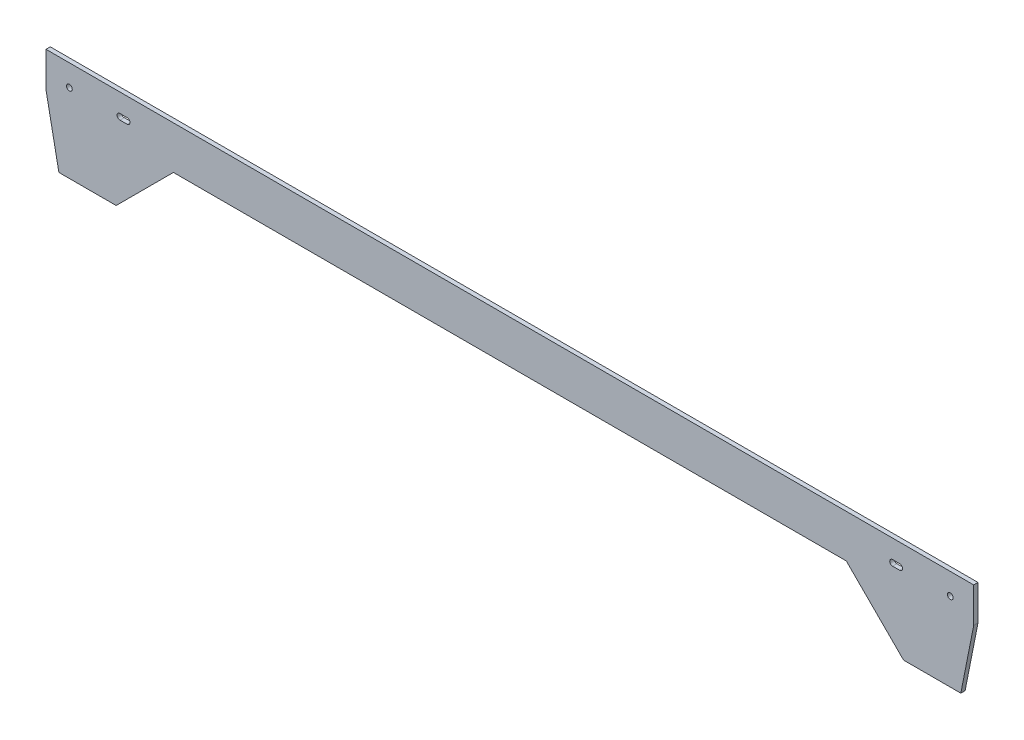
ISO-10303-21;
HEADER;
FILE_DESCRIPTION(('STEP AP214'),'2;1');
FILE_NAME('part.step','',(''),(''),'','','');
FILE_SCHEMA(('AUTOMOTIVE_DESIGN { 1 0 10303 214 1 1 1 1 }'));
ENDSEC;
DATA;
#1=APPLICATION_CONTEXT('core data for automotive mechanical design processes');
#2=APPLICATION_PROTOCOL_DEFINITION('international standard','automotive_design',2000,#1);
#3=PRODUCT_CONTEXT('',#1,'mechanical');
#4=PRODUCT('Part','Part','',(#3));
#5=PRODUCT_RELATED_PRODUCT_CATEGORY('part','',(#4));
#6=PRODUCT_DEFINITION_FORMATION('','',#4);
#7=PRODUCT_DEFINITION_CONTEXT('part definition',#1,'design');
#8=PRODUCT_DEFINITION('design','',#6,#7);
#9=PRODUCT_DEFINITION_SHAPE('','',#8);
#10=(LENGTH_UNIT() NAMED_UNIT(*) SI_UNIT(.MILLI.,.METRE.));
#11=(NAMED_UNIT(*) PLANE_ANGLE_UNIT() SI_UNIT($,.RADIAN.));
#12=(NAMED_UNIT(*) SI_UNIT($,.STERADIAN.) SOLID_ANGLE_UNIT());
#13=UNCERTAINTY_MEASURE_WITH_UNIT(LENGTH_MEASURE(1.E-05),#10,'distance_accuracy_value','');
#14=(GEOMETRIC_REPRESENTATION_CONTEXT(3) GLOBAL_UNCERTAINTY_ASSIGNED_CONTEXT((#13)) GLOBAL_UNIT_ASSIGNED_CONTEXT((#10,
#11,#12)) REPRESENTATION_CONTEXT('',''));
#15=CARTESIAN_POINT('',(0.,0.,0.));
#16=DIRECTION('',(0.,0.,1.));
#17=DIRECTION('',(1.,0.,0.));
#18=AXIS2_PLACEMENT_3D('',#15,#16,#17);
#19=CARTESIAN_POINT('',(0.,-4.00000000000001,6.));
#20=DIRECTION('',(0.,-1.,0.));
#21=DIRECTION('',(0.,0.,-1.));
#22=AXIS2_PLACEMENT_3D('',#19,#20,#21);
#23=PLANE('',#22);
#24=DIRECTION('',(-1.,0.,0.));
#25=VECTOR('',#24,1.);
#26=CARTESIAN_POINT('',(0.,-4.00000000000001,0.));
#27=LINE('',#26,#25);
#28=CARTESIAN_POINT('',(544.7,-4.00000000000001,0.));
#29=VERTEX_POINT('',#28);
#30=CARTESIAN_POINT('',(534.7,-4.00000000000001,0.));
#31=VERTEX_POINT('',#30);
#32=EDGE_CURVE('E242',#29,#31,#27,.T.);
#33=ORIENTED_EDGE('',*,*,#32,.T.);
#34=DIRECTION('',(0.,0.,-1.));
#35=VECTOR('',#34,1.);
#36=CARTESIAN_POINT('',(534.7,-4.00000000000001,6.));
#37=LINE('',#36,#35);
#38=CARTESIAN_POINT('',(534.7,-4.00000000000001,6.));
#39=VERTEX_POINT('',#38);
#40=EDGE_CURVE('E11',#39,#31,#37,.T.);
#41=ORIENTED_EDGE('',*,*,#40,.F.);
#42=DIRECTION('',(-1.,0.,0.));
#43=VECTOR('',#42,1.);
#44=CARTESIAN_POINT('',(0.,-4.00000000000001,6.));
#45=LINE('',#44,#43);
#46=CARTESIAN_POINT('',(544.7,-4.00000000000001,6.));
#47=VERTEX_POINT('',#46);
#48=EDGE_CURVE('E178',#47,#39,#45,.T.);
#49=ORIENTED_EDGE('',*,*,#48,.F.);
#50=DIRECTION('',(0.,0.,-1.));
#51=VECTOR('',#50,1.);
#52=CARTESIAN_POINT('',(544.7,-4.00000000000001,6.));
#53=LINE('',#52,#51);
#54=EDGE_CURVE('E58',#47,#29,#53,.T.);
#55=ORIENTED_EDGE('',*,*,#54,.T.);
#56=EDGE_LOOP('',(#33,#41,#49,#55));
#57=FACE_BOUND('',#56,.T.);
#58=ADVANCED_FACE('F39',(#57),#23,.F.);
#59=CARTESIAN_POINT('',(534.7,0.,6.));
#60=DIRECTION('',(0.,0.,-1.));
#61=DIRECTION('',(-1.,0.,0.));
#62=AXIS2_PLACEMENT_3D('',#59,#60,#61);
#63=CYLINDRICAL_SURFACE('',#62,4.);
#64=CARTESIAN_POINT('',(534.7,0.,0.));
#65=DIRECTION('',(0.,0.,1.));
#66=DIRECTION('',(1.,0.,0.));
#67=AXIS2_PLACEMENT_3D('',#64,#65,#66);
#68=CIRCLE('',#67,4.);
#69=CARTESIAN_POINT('',(534.7,4.,0.));
#70=VERTEX_POINT('',#69);
#71=EDGE_CURVE('E184',#31,#70,#68,.F.);
#72=ORIENTED_EDGE('',*,*,#71,.T.);
#73=DIRECTION('',(0.,0.,-1.));
#74=VECTOR('',#73,1.);
#75=CARTESIAN_POINT('',(534.7,4.,6.));
#76=LINE('',#75,#74);
#77=CARTESIAN_POINT('',(534.7,4.,6.));
#78=VERTEX_POINT('',#77);
#79=EDGE_CURVE('E49',#78,#70,#76,.T.);
#80=ORIENTED_EDGE('',*,*,#79,.F.);
#81=CARTESIAN_POINT('',(534.7,0.,6.));
#82=DIRECTION('',(0.,0.,1.));
#83=DIRECTION('',(1.,0.,0.));
#84=AXIS2_PLACEMENT_3D('',#81,#82,#83);
#85=CIRCLE('',#84,4.);
#86=EDGE_CURVE('E172',#39,#78,#85,.F.);
#87=ORIENTED_EDGE('',*,*,#86,.F.);
#88=ORIENTED_EDGE('',*,*,#40,.T.);
#89=EDGE_LOOP('',(#72,#80,#87,#88));
#90=FACE_BOUND('',#89,.T.);
#91=ADVANCED_FACE('F183',(#90),#63,.F.);
#92=CARTESIAN_POINT('',(0.,4.00000000000111,6.));
#93=DIRECTION('',(0.,-1.,0.));
#94=DIRECTION('',(1.,0.,0.));
#95=AXIS2_PLACEMENT_3D('',#92,#93,#94);
#96=PLANE('',#95);
#97=DIRECTION('',(-1.,0.,0.));
#98=VECTOR('',#97,1.);
#99=CARTESIAN_POINT('',(0.,4.00000000000111,0.));
#100=LINE('',#99,#98);
#101=CARTESIAN_POINT('',(544.7,3.99999999999998,0.));
#102=VERTEX_POINT('',#101);
#103=EDGE_CURVE('E245',#102,#70,#100,.T.);
#104=ORIENTED_EDGE('',*,*,#103,.F.);
#105=DIRECTION('',(0.,0.,-1.));
#106=VECTOR('',#105,1.);
#107=CARTESIAN_POINT('',(544.7,3.99999999999998,6.));
#108=LINE('',#107,#106);
#109=CARTESIAN_POINT('',(544.7,3.99999999999998,6.));
#110=VERTEX_POINT('',#109);
#111=EDGE_CURVE('E114',#110,#102,#108,.T.);
#112=ORIENTED_EDGE('',*,*,#111,.F.);
#113=DIRECTION('',(-1.,0.,0.));
#114=VECTOR('',#113,1.);
#115=CARTESIAN_POINT('',(0.,4.00000000000111,6.));
#116=LINE('',#115,#114);
#117=EDGE_CURVE('E177',#110,#78,#116,.T.);
#118=ORIENTED_EDGE('',*,*,#117,.T.);
#119=ORIENTED_EDGE('',*,*,#79,.T.);
#120=EDGE_LOOP('',(#104,#112,#118,#119));
#121=FACE_BOUND('',#120,.T.);
#122=ADVANCED_FACE('F188',(#121),#96,.T.);
#123=CARTESIAN_POINT('',(647.999999999997,-5.57921056292962E-11,6.));
#124=DIRECTION('',(1.,0.,0.));
#125=DIRECTION('',(0.,1.,0.));
#126=AXIS2_PLACEMENT_3D('',#123,#124,#125);
#127=PLANE('',#126);
#128=DIRECTION('',(0.,-1.,0.));
#129=VECTOR('',#128,1.);
#130=CARTESIAN_POINT('',(647.999999999997,-5.57921056292962E-11,0.));
#131=LINE('',#130,#129);
#132=CARTESIAN_POINT('',(648.,30.0000000000096,0.));
#133=VERTEX_POINT('',#132);
#134=CARTESIAN_POINT('',(647.999999999995,-19.0000000000165,0.));
#135=VERTEX_POINT('',#134);
#136=EDGE_CURVE('E206',#133,#135,#131,.T.);
#137=ORIENTED_EDGE('',*,*,#136,.F.);
#138=DIRECTION('',(0.,0.,-1.));
#139=VECTOR('',#138,1.);
#140=CARTESIAN_POINT('',(648.,30.0000000000096,6.));
#141=LINE('',#140,#139);
#142=CARTESIAN_POINT('',(648.,30.0000000000096,6.));
#143=VERTEX_POINT('',#142);
#144=EDGE_CURVE('E252',#143,#133,#141,.T.);
#145=ORIENTED_EDGE('',*,*,#144,.F.);
#146=DIRECTION('',(0.,-1.,0.));
#147=VECTOR('',#146,1.);
#148=CARTESIAN_POINT('',(647.999999999997,-5.57921056292962E-11,6.));
#149=LINE('',#148,#147);
#150=CARTESIAN_POINT('',(647.999999999995,-19.0000000000165,6.));
#151=VERTEX_POINT('',#150);
#152=EDGE_CURVE('E301',#143,#151,#149,.T.);
#153=ORIENTED_EDGE('',*,*,#152,.T.);
#154=DIRECTION('',(0.,0.,-1.));
#155=VECTOR('',#154,1.);
#156=CARTESIAN_POINT('',(647.999999999995,-19.0000000000165,6.));
#157=LINE('',#156,#155);
#158=EDGE_CURVE('E254',#151,#135,#157,.T.);
#159=ORIENTED_EDGE('',*,*,#158,.T.);
#160=EDGE_LOOP('',(#137,#145,#153,#159));
#161=FACE_BOUND('',#160,.T.);
#162=ADVANCED_FACE('F407',(#161),#127,.T.);
#163=CARTESIAN_POINT('',(-6.03900610071994E-12,29.9999999998792,6.));
#164=DIRECTION('',(2.01300203358142E-13,-1.,0.));
#165=DIRECTION('',(1.,2.01300203358142E-13,0.));
#166=AXIS2_PLACEMENT_3D('',#163,#164,#165);
#167=PLANE('',#166);
#168=DIRECTION('',(-1.,-2.01300203358142E-13,0.));
#169=VECTOR('',#168,1.);
#170=CARTESIAN_POINT('',(-6.03900610071994E-12,29.9999999998792,0.));
#171=LINE('',#170,#169);
#172=CARTESIAN_POINT('',(-648.,30.,0.));
#173=VERTEX_POINT('',#172);
#174=EDGE_CURVE('E209',#133,#173,#171,.T.);
#175=ORIENTED_EDGE('',*,*,#174,.T.);
#176=DIRECTION('',(0.,0.,-1.));
#177=VECTOR('',#176,1.);
#178=CARTESIAN_POINT('',(-648.,30.,6.));
#179=LINE('',#178,#177);
#180=CARTESIAN_POINT('',(-648.,30.,6.));
#181=VERTEX_POINT('',#180);
#182=EDGE_CURVE('E272',#181,#173,#179,.T.);
#183=ORIENTED_EDGE('',*,*,#182,.F.);
#184=DIRECTION('',(-1.,-2.01300203358142E-13,0.));
#185=VECTOR('',#184,1.);
#186=CARTESIAN_POINT('',(-6.03900610071994E-12,29.9999999998792,6.));
#187=LINE('',#186,#185);
#188=EDGE_CURVE('E305',#143,#181,#187,.T.);
#189=ORIENTED_EDGE('',*,*,#188,.F.);
#190=ORIENTED_EDGE('',*,*,#144,.T.);
#191=EDGE_LOOP('',(#175,#183,#189,#190));
#192=FACE_BOUND('',#191,.T.);
#193=ADVANCED_FACE('F403',(#192),#167,.F.);
#194=CARTESIAN_POINT('',(-648.,0.,6.));
#195=DIRECTION('',(1.,0.,0.));
#196=DIRECTION('',(0.,0.,-1.));
#197=AXIS2_PLACEMENT_3D('',#194,#195,#196);
#198=PLANE('',#197);
#199=DIRECTION('',(0.,-1.,0.));
#200=VECTOR('',#199,1.);
#201=CARTESIAN_POINT('',(-648.,0.,0.));
#202=LINE('',#201,#200);
#203=CARTESIAN_POINT('',(-648.,-19.,0.));
#204=VERTEX_POINT('',#203);
#205=EDGE_CURVE('E212',#173,#204,#202,.T.);
#206=ORIENTED_EDGE('',*,*,#205,.T.);
#207=DIRECTION('',(0.,0.,-1.));
#208=VECTOR('',#207,1.);
#209=CARTESIAN_POINT('',(-648.,-19.,6.));
#210=LINE('',#209,#208);
#211=CARTESIAN_POINT('',(-648.,-19.,6.));
#212=VERTEX_POINT('',#211);
#213=EDGE_CURVE('E269',#212,#204,#210,.T.);
#214=ORIENTED_EDGE('',*,*,#213,.F.);
#215=DIRECTION('',(0.,-1.,0.));
#216=VECTOR('',#215,1.);
#217=CARTESIAN_POINT('',(-648.,0.,6.));
#218=LINE('',#217,#216);
#219=EDGE_CURVE('E312',#181,#212,#218,.T.);
#220=ORIENTED_EDGE('',*,*,#219,.F.);
#221=ORIENTED_EDGE('',*,*,#182,.T.);
#222=EDGE_LOOP('',(#206,#214,#220,#221));
#223=FACE_BOUND('',#222,.T.);
#224=ADVANCED_FACE('F399',(#223),#198,.F.);
#225=CARTESIAN_POINT('',(-627.217896571761,-124.065078442766,6.));
#226=DIRECTION('',(0.980993105174429,0.194042592232304,0.));
#227=DIRECTION('',(-0.194042592232304,0.980993105174429,0.));
#228=AXIS2_PLACEMENT_3D('',#225,#226,#227);
#229=PLANE('',#228);
#230=DIRECTION('',(0.194042592232304,-0.980993105174429,0.));
#231=VECTOR('',#230,1.);
#232=CARTESIAN_POINT('',(-627.217896571761,-124.065078442766,0.));
#233=LINE('',#232,#231);
#234=CARTESIAN_POINT('',(-630.,-110.,0.));
#235=VERTEX_POINT('',#234);
#236=EDGE_CURVE('E215',#204,#235,#233,.T.);
#237=ORIENTED_EDGE('',*,*,#236,.T.);
#238=DIRECTION('',(0.,0.,-1.));
#239=VECTOR('',#238,1.);
#240=CARTESIAN_POINT('',(-630.,-110.,6.));
#241=LINE('',#240,#239);
#242=CARTESIAN_POINT('',(-630.,-110.,6.));
#243=VERTEX_POINT('',#242);
#244=EDGE_CURVE('E267',#243,#235,#241,.T.);
#245=ORIENTED_EDGE('',*,*,#244,.F.);
#246=DIRECTION('',(0.194042592232304,-0.980993105174429,0.));
#247=VECTOR('',#246,1.);
#248=CARTESIAN_POINT('',(-627.217896571761,-124.065078442766,6.));
#249=LINE('',#248,#247);
#250=EDGE_CURVE('E315',#212,#243,#249,.T.);
#251=ORIENTED_EDGE('',*,*,#250,.F.);
#252=ORIENTED_EDGE('',*,*,#213,.T.);
#253=EDGE_LOOP('',(#237,#245,#251,#252));
#254=FACE_BOUND('',#253,.T.);
#255=ADVANCED_FACE('F395',(#254),#229,.F.);
#256=CARTESIAN_POINT('',(0.,-110.,6.));
#257=DIRECTION('',(0.,-1.,0.));
#258=DIRECTION('',(0.,0.,-1.));
#259=AXIS2_PLACEMENT_3D('',#256,#257,#258);
#260=PLANE('',#259);
#261=DIRECTION('',(-1.,0.,0.));
#262=VECTOR('',#261,1.);
#263=CARTESIAN_POINT('',(0.,-110.,0.));
#264=LINE('',#263,#262);
#265=CARTESIAN_POINT('',(-550.,-110.,0.));
#266=VERTEX_POINT('',#265);
#267=EDGE_CURVE('E218',#266,#235,#264,.T.);
#268=ORIENTED_EDGE('',*,*,#267,.F.);
#269=DIRECTION('',(0.,0.,-1.));
#270=VECTOR('',#269,1.);
#271=CARTESIAN_POINT('',(-550.,-110.,6.));
#272=LINE('',#271,#270);
#273=CARTESIAN_POINT('',(-550.,-110.,6.));
#274=VERTEX_POINT('',#273);
#275=EDGE_CURVE('E265',#274,#266,#272,.T.);
#276=ORIENTED_EDGE('',*,*,#275,.F.);
#277=DIRECTION('',(-1.,0.,0.));
#278=VECTOR('',#277,1.);
#279=CARTESIAN_POINT('',(0.,-110.,6.));
#280=LINE('',#279,#278);
#281=EDGE_CURVE('E317',#274,#243,#280,.T.);
#282=ORIENTED_EDGE('',*,*,#281,.T.);
#283=ORIENTED_EDGE('',*,*,#244,.T.);
#284=EDGE_LOOP('',(#268,#276,#282,#283));
#285=FACE_BOUND('',#284,.T.);
#286=ADVANCED_FACE('F391',(#285),#260,.T.);
#287=CARTESIAN_POINT('',(-220.000000000001,220.,6.));
#288=DIRECTION('',(-0.707106781186549,0.707106781186546,0.));
#289=DIRECTION('',(-0.707106781186546,-0.707106781186549,0.));
#290=AXIS2_PLACEMENT_3D('',#287,#288,#289);
#291=PLANE('',#290);
#292=DIRECTION('',(0.707106781186546,0.707106781186549,0.));
#293=VECTOR('',#292,1.);
#294=CARTESIAN_POINT('',(-220.000000000001,220.,0.));
#295=LINE('',#294,#293);
#296=CARTESIAN_POINT('',(-470.000000000001,-30.0000000000002,0.));
#297=VERTEX_POINT('',#296);
#298=EDGE_CURVE('E221',#266,#297,#295,.T.);
#299=ORIENTED_EDGE('',*,*,#298,.T.);
#300=DIRECTION('',(0.,0.,-1.));
#301=VECTOR('',#300,1.);
#302=CARTESIAN_POINT('',(-470.000000000001,-30.0000000000002,6.));
#303=LINE('',#302,#301);
#304=CARTESIAN_POINT('',(-470.000000000001,-30.0000000000002,6.));
#305=VERTEX_POINT('',#304);
#306=EDGE_CURVE('E262',#305,#297,#303,.T.);
#307=ORIENTED_EDGE('',*,*,#306,.F.);
#308=DIRECTION('',(0.707106781186546,0.707106781186549,0.));
#309=VECTOR('',#308,1.);
#310=CARTESIAN_POINT('',(-220.000000000001,220.,6.));
#311=LINE('',#310,#309);
#312=EDGE_CURVE('E320',#274,#305,#311,.T.);
#313=ORIENTED_EDGE('',*,*,#312,.F.);
#314=ORIENTED_EDGE('',*,*,#275,.T.);
#315=EDGE_LOOP('',(#299,#307,#313,#314));
#316=FACE_BOUND('',#315,.T.);
#317=ADVANCED_FACE('F387',(#316),#291,.F.);
#318=CARTESIAN_POINT('',(2.23668601370601E-13,-29.9999999999966,6.));
#319=DIRECTION('',(0.,1.,0.));
#320=DIRECTION('',(-1.,0.,0.));
#321=AXIS2_PLACEMENT_3D('',#318,#319,#320);
#322=PLANE('',#321);
#323=DIRECTION('',(1.,0.,0.));
#324=VECTOR('',#323,1.);
#325=CARTESIAN_POINT('',(2.23668601370601E-13,-29.9999999999966,0.));
#326=LINE('',#325,#324);
#327=CARTESIAN_POINT('',(470.000000000001,-29.9999999999932,0.));
#328=VERTEX_POINT('',#327);
#329=EDGE_CURVE('E224',#297,#328,#326,.T.);
#330=ORIENTED_EDGE('',*,*,#329,.T.);
#331=DIRECTION('',(0.,0.,-1.));
#332=VECTOR('',#331,1.);
#333=CARTESIAN_POINT('',(470.000000000001,-29.9999999999932,6.));
#334=LINE('',#333,#332);
#335=CARTESIAN_POINT('',(470.000000000001,-29.9999999999932,6.));
#336=VERTEX_POINT('',#335);
#337=EDGE_CURVE('E260',#336,#328,#334,.T.);
#338=ORIENTED_EDGE('',*,*,#337,.F.);
#339=DIRECTION('',(1.,0.,0.));
#340=VECTOR('',#339,1.);
#341=CARTESIAN_POINT('',(2.23668601370601E-13,-29.9999999999966,6.));
#342=LINE('',#341,#340);
#343=EDGE_CURVE('E323',#305,#336,#342,.T.);
#344=ORIENTED_EDGE('',*,*,#343,.F.);
#345=ORIENTED_EDGE('',*,*,#306,.T.);
#346=EDGE_LOOP('',(#330,#338,#344,#345));
#347=FACE_BOUND('',#346,.T.);
#348=ADVANCED_FACE('F383',(#347),#322,.F.);
#349=CARTESIAN_POINT('',(220.000000000023,220.000000000005,6.));
#350=DIRECTION('',(-0.707106781186576,-0.707106781186518,0.));
#351=DIRECTION('',(0.707106781186518,-0.707106781186576,0.));
#352=AXIS2_PLACEMENT_3D('',#349,#350,#351);
#353=PLANE('',#352);
#354=DIRECTION('',(-0.707106781186518,0.707106781186577,0.));
#355=VECTOR('',#354,1.);
#356=CARTESIAN_POINT('',(220.000000000023,220.000000000005,0.));
#357=LINE('',#356,#355);
#358=CARTESIAN_POINT('',(550.000000000007,-110.000000000006,0.));
#359=VERTEX_POINT('',#358);
#360=EDGE_CURVE('E227',#359,#328,#357,.T.);
#361=ORIENTED_EDGE('',*,*,#360,.F.);
#362=DIRECTION('',(0.,0.,-1.));
#363=VECTOR('',#362,1.);
#364=CARTESIAN_POINT('',(550.000000000007,-110.000000000006,6.));
#365=LINE('',#364,#363);
#366=CARTESIAN_POINT('',(550.000000000007,-110.000000000006,6.));
#367=VERTEX_POINT('',#366);
#368=EDGE_CURVE('E258',#367,#359,#365,.T.);
#369=ORIENTED_EDGE('',*,*,#368,.F.);
#370=DIRECTION('',(-0.707106781186518,0.707106781186577,0.));
#371=VECTOR('',#370,1.);
#372=CARTESIAN_POINT('',(220.000000000023,220.000000000005,6.));
#373=LINE('',#372,#371);
#374=EDGE_CURVE('E325',#367,#336,#373,.T.);
#375=ORIENTED_EDGE('',*,*,#374,.T.);
#376=ORIENTED_EDGE('',*,*,#337,.T.);
#377=EDGE_LOOP('',(#361,#369,#375,#376));
#378=FACE_BOUND('',#377,.T.);
#379=ADVANCED_FACE('F379',(#378),#353,.T.);
#380=CARTESIAN_POINT('',(0.,-110.000000000006,6.));
#381=DIRECTION('',(0.,-1.,0.));
#382=DIRECTION('',(0.,0.,-1.));
#383=AXIS2_PLACEMENT_3D('',#380,#381,#382);
#384=PLANE('',#383);
#385=DIRECTION('',(-1.,0.,0.));
#386=VECTOR('',#385,1.);
#387=CARTESIAN_POINT('',(0.,-110.000000000006,0.));
#388=LINE('',#387,#386);
#389=CARTESIAN_POINT('',(629.999999999999,-110.000000000006,0.));
#390=VERTEX_POINT('',#389);
#391=EDGE_CURVE('E230',#390,#359,#388,.T.);
#392=ORIENTED_EDGE('',*,*,#391,.F.);
#393=DIRECTION('',(0.,0.,-1.));
#394=VECTOR('',#393,1.);
#395=CARTESIAN_POINT('',(629.999999999999,-110.000000000006,6.));
#396=LINE('',#395,#394);
#397=CARTESIAN_POINT('',(629.999999999999,-110.000000000006,6.));
#398=VERTEX_POINT('',#397);
#399=EDGE_CURVE('E256',#398,#390,#396,.T.);
#400=ORIENTED_EDGE('',*,*,#399,.F.);
#401=DIRECTION('',(-1.,0.,0.));
#402=VECTOR('',#401,1.);
#403=CARTESIAN_POINT('',(0.,-110.000000000006,6.));
#404=LINE('',#403,#402);
#405=EDGE_CURVE('E328',#398,#367,#404,.T.);
#406=ORIENTED_EDGE('',*,*,#405,.T.);
#407=ORIENTED_EDGE('',*,*,#368,.T.);
#408=EDGE_LOOP('',(#392,#400,#406,#407));
#409=FACE_BOUND('',#408,.T.);
#410=ADVANCED_FACE('F376',(#409),#384,.T.);
#411=CARTESIAN_POINT('',(-534.7,0.,6.));
#412=DIRECTION('',(0.,0.,-1.));
#413=DIRECTION('',(-1.,0.,0.));
#414=AXIS2_PLACEMENT_3D('',#411,#412,#413);
#415=CYLINDRICAL_SURFACE('',#414,4.);
#416=CARTESIAN_POINT('',(-534.7,0.,0.));
#417=DIRECTION('',(0.,0.,1.));
#418=DIRECTION('',(1.,0.,0.));
#419=AXIS2_PLACEMENT_3D('',#416,#417,#418);
#420=CIRCLE('',#419,4.);
#421=CARTESIAN_POINT('',(-534.7,-4.00000000000001,0.));
#422=VERTEX_POINT('',#421);
#423=CARTESIAN_POINT('',(-534.7,4.,0.));
#424=VERTEX_POINT('',#423);
#425=EDGE_CURVE('E195',#422,#424,#420,.T.);
#426=ORIENTED_EDGE('',*,*,#425,.F.);
#427=DIRECTION('',(0.,0.,-1.));
#428=VECTOR('',#427,1.);
#429=CARTESIAN_POINT('',(-534.7,-4.00000000000001,6.));
#430=LINE('',#429,#428);
#431=CARTESIAN_POINT('',(-534.7,-4.00000000000001,6.));
#432=VERTEX_POINT('',#431);
#433=EDGE_CURVE('E43',#432,#422,#430,.T.);
#434=ORIENTED_EDGE('',*,*,#433,.F.);
#435=CARTESIAN_POINT('',(-534.7,0.,6.));
#436=DIRECTION('',(0.,0.,1.));
#437=DIRECTION('',(1.,0.,0.));
#438=AXIS2_PLACEMENT_3D('',#435,#436,#437);
#439=CIRCLE('',#438,4.);
#440=CARTESIAN_POINT('',(-534.7,4.,6.));
#441=VERTEX_POINT('',#440);
#442=EDGE_CURVE('E250',#432,#441,#439,.T.);
#443=ORIENTED_EDGE('',*,*,#442,.T.);
#444=DIRECTION('',(0.,0.,-1.));
#445=VECTOR('',#444,1.);
#446=CARTESIAN_POINT('',(-534.7,4.,6.));
#447=LINE('',#446,#445);
#448=EDGE_CURVE('E191',#441,#424,#447,.T.);
#449=ORIENTED_EDGE('',*,*,#448,.T.);
#450=EDGE_LOOP('',(#426,#434,#443,#449));
#451=FACE_BOUND('',#450,.T.);
#452=ADVANCED_FACE('F41',(#451),#415,.F.);
#453=CARTESIAN_POINT('',(0.,-4.00000000000001,6.));
#454=DIRECTION('',(0.,1.,0.));
#455=DIRECTION('',(0.,0.,1.));
#456=AXIS2_PLACEMENT_3D('',#453,#454,#455);
#457=PLANE('',#456);
#458=DIRECTION('',(1.,0.,0.));
#459=VECTOR('',#458,1.);
#460=CARTESIAN_POINT('',(0.,-4.00000000000001,0.));
#461=LINE('',#460,#459);
#462=CARTESIAN_POINT('',(-544.7,-4.00000000000001,0.));
#463=VERTEX_POINT('',#462);
#464=EDGE_CURVE('E198',#463,#422,#461,.T.);
#465=ORIENTED_EDGE('',*,*,#464,.F.);
#466=DIRECTION('',(0.,0.,-1.));
#467=VECTOR('',#466,1.);
#468=CARTESIAN_POINT('',(-544.7,-4.00000000000001,6.));
#469=LINE('',#468,#467);
#470=CARTESIAN_POINT('',(-544.7,-4.00000000000001,6.));
#471=VERTEX_POINT('',#470);
#472=EDGE_CURVE('E279',#471,#463,#469,.T.);
#473=ORIENTED_EDGE('',*,*,#472,.F.);
#474=DIRECTION('',(1.,0.,0.));
#475=VECTOR('',#474,1.);
#476=CARTESIAN_POINT('',(0.,-4.00000000000001,6.));
#477=LINE('',#476,#475);
#478=EDGE_CURVE('E288',#471,#432,#477,.T.);
#479=ORIENTED_EDGE('',*,*,#478,.T.);
#480=ORIENTED_EDGE('',*,*,#433,.T.);
#481=EDGE_LOOP('',(#465,#473,#479,#480));
#482=FACE_BOUND('',#481,.T.);
#483=ADVANCED_FACE('F286',(#482),#457,.T.);
#484=CARTESIAN_POINT('',(-544.7,0.,6.));
#485=DIRECTION('',(0.,0.,-1.));
#486=DIRECTION('',(-1.,0.,0.));
#487=AXIS2_PLACEMENT_3D('',#484,#485,#486);
#488=CYLINDRICAL_SURFACE('',#487,3.99999999999999);
#489=CARTESIAN_POINT('',(-544.7,0.,0.));
#490=DIRECTION('',(0.,0.,1.));
#491=DIRECTION('',(1.,0.,0.));
#492=AXIS2_PLACEMENT_3D('',#489,#490,#491);
#493=CIRCLE('',#492,3.99999999999999);
#494=CARTESIAN_POINT('',(-544.7,3.99999999999998,0.));
#495=VERTEX_POINT('',#494);
#496=EDGE_CURVE('E201',#463,#495,#493,.F.);
#497=ORIENTED_EDGE('',*,*,#496,.T.);
#498=DIRECTION('',(0.,0.,-1.));
#499=VECTOR('',#498,1.);
#500=CARTESIAN_POINT('',(-544.7,3.99999999999998,6.));
#501=LINE('',#500,#499);
#502=CARTESIAN_POINT('',(-544.7,3.99999999999998,6.));
#503=VERTEX_POINT('',#502);
#504=EDGE_CURVE('E277',#503,#495,#501,.T.);
#505=ORIENTED_EDGE('',*,*,#504,.F.);
#506=CARTESIAN_POINT('',(-544.7,0.,6.));
#507=DIRECTION('',(0.,0.,1.));
#508=DIRECTION('',(1.,0.,0.));
#509=AXIS2_PLACEMENT_3D('',#506,#507,#508);
#510=CIRCLE('',#509,3.99999999999999);
#511=EDGE_CURVE('E302',#471,#503,#510,.F.);
#512=ORIENTED_EDGE('',*,*,#511,.F.);
#513=ORIENTED_EDGE('',*,*,#472,.T.);
#514=EDGE_LOOP('',(#497,#505,#512,#513));
#515=FACE_BOUND('',#514,.T.);
#516=ADVANCED_FACE('F295',(#515),#488,.F.);
#517=CARTESIAN_POINT('',(615.3,9.17134403136266E-12,6.));
#518=DIRECTION('',(0.,0.,-1.));
#519=DIRECTION('',(-1.,0.,0.));
#520=AXIS2_PLACEMENT_3D('',#517,#518,#519);
#521=CYLINDRICAL_SURFACE('',#520,3.99999999999999);
#522=CARTESIAN_POINT('',(615.3,9.17134403136266E-12,6.));
#523=DIRECTION('',(0.,0.,1.));
#524=DIRECTION('',(1.,0.,0.));
#525=AXIS2_PLACEMENT_3D('',#522,#523,#524);
#526=CIRCLE('',#525,3.99999999999999);
#527=CARTESIAN_POINT('',(619.3,9.17134403136266E-12,6.));
#528=VERTEX_POINT('',#527);
#529=EDGE_CURVE('E337',#528,#528,#526,.F.);
#530=ORIENTED_EDGE('',*,*,#529,.F.);
#531=EDGE_LOOP('',(#530));
#532=FACE_BOUND('',#531,.T.);
#533=CARTESIAN_POINT('',(615.3,9.17134403136266E-12,0.));
#534=DIRECTION('',(0.,0.,1.));
#535=DIRECTION('',(1.,0.,0.));
#536=AXIS2_PLACEMENT_3D('',#533,#534,#535);
#537=CIRCLE('',#536,3.99999999999999);
#538=CARTESIAN_POINT('',(619.3,9.17134403136266E-12,0.));
#539=VERTEX_POINT('',#538);
#540=EDGE_CURVE('E239',#539,#539,#537,.F.);
#541=ORIENTED_EDGE('',*,*,#540,.T.);
#542=EDGE_LOOP('',(#541));
#543=FACE_BOUND('',#542,.T.);
#544=ADVANCED_FACE('F342',(#532,#543),#521,.F.);
#545=CARTESIAN_POINT('',(-615.3,0.,6.));
#546=DIRECTION('',(0.,0.,-1.));
#547=DIRECTION('',(-1.,0.,0.));
#548=AXIS2_PLACEMENT_3D('',#545,#546,#547);
#549=CYLINDRICAL_SURFACE('',#548,3.99999999999999);
#550=CARTESIAN_POINT('',(-615.3,0.,6.));
#551=DIRECTION('',(0.,0.,1.));
#552=DIRECTION('',(1.,0.,0.));
#553=AXIS2_PLACEMENT_3D('',#550,#551,#552);
#554=CIRCLE('',#553,3.99999999999999);
#555=CARTESIAN_POINT('',(-611.3,0.,6.));
#556=VERTEX_POINT('',#555);
#557=EDGE_CURVE('E334',#556,#556,#554,.T.);
#558=ORIENTED_EDGE('',*,*,#557,.T.);
#559=EDGE_LOOP('',(#558));
#560=FACE_BOUND('',#559,.T.);
#561=CARTESIAN_POINT('',(-615.3,0.,0.));
#562=DIRECTION('',(0.,0.,1.));
#563=DIRECTION('',(1.,0.,0.));
#564=AXIS2_PLACEMENT_3D('',#561,#562,#563);
#565=CIRCLE('',#564,3.99999999999999);
#566=CARTESIAN_POINT('',(-611.3,0.,0.));
#567=VERTEX_POINT('',#566);
#568=EDGE_CURVE('E236',#567,#567,#565,.T.);
#569=ORIENTED_EDGE('',*,*,#568,.F.);
#570=EDGE_LOOP('',(#569));
#571=FACE_BOUND('',#570,.T.);
#572=ADVANCED_FACE('F345',(#560,#571),#549,.F.);
#573=CARTESIAN_POINT('',(627.217896571762,-124.065078442757,6.));
#574=DIRECTION('',(0.980993105174431,-0.194042592232291,0.));
#575=DIRECTION('',(0.194042592232291,0.980993105174431,0.));
#576=AXIS2_PLACEMENT_3D('',#573,#574,#575);
#577=PLANE('',#576);
#578=DIRECTION('',(-0.194042592232291,-0.980993105174431,0.));
#579=VECTOR('',#578,1.);
#580=CARTESIAN_POINT('',(627.217896571762,-124.065078442757,0.));
#581=LINE('',#580,#579);
#582=EDGE_CURVE('E233',#135,#390,#581,.T.);
#583=ORIENTED_EDGE('',*,*,#582,.F.);
#584=ORIENTED_EDGE('',*,*,#158,.F.);
#585=DIRECTION('',(-0.194042592232291,-0.980993105174431,0.));
#586=VECTOR('',#585,1.);
#587=CARTESIAN_POINT('',(627.217896571762,-124.065078442757,6.));
#588=LINE('',#587,#586);
#589=EDGE_CURVE('E331',#151,#398,#588,.T.);
#590=ORIENTED_EDGE('',*,*,#589,.T.);
#591=ORIENTED_EDGE('',*,*,#399,.T.);
#592=EDGE_LOOP('',(#583,#584,#590,#591));
#593=FACE_BOUND('',#592,.T.);
#594=ADVANCED_FACE('F360',(#593),#577,.T.);
#595=CARTESIAN_POINT('',(0.,4.00000000000111,6.));
#596=DIRECTION('',(0.,1.,0.));
#597=DIRECTION('',(-1.,0.,0.));
#598=AXIS2_PLACEMENT_3D('',#595,#596,#597);
#599=PLANE('',#598);
#600=DIRECTION('',(1.,0.,0.));
#601=VECTOR('',#600,1.);
#602=CARTESIAN_POINT('',(0.,4.00000000000111,0.));
#603=LINE('',#602,#601);
#604=EDGE_CURVE('E203',#495,#424,#603,.T.);
#605=ORIENTED_EDGE('',*,*,#604,.T.);
#606=ORIENTED_EDGE('',*,*,#448,.F.);
#607=DIRECTION('',(1.,0.,0.));
#608=VECTOR('',#607,1.);
#609=CARTESIAN_POINT('',(0.,4.00000000000111,6.));
#610=LINE('',#609,#608);
#611=EDGE_CURVE('E299',#503,#441,#610,.T.);
#612=ORIENTED_EDGE('',*,*,#611,.F.);
#613=ORIENTED_EDGE('',*,*,#504,.T.);
#614=EDGE_LOOP('',(#605,#606,#612,#613));
#615=FACE_BOUND('',#614,.T.);
#616=ADVANCED_FACE('F298',(#615),#599,.F.);
#617=CARTESIAN_POINT('',(544.7,8.10969326406485E-12,6.));
#618=DIRECTION('',(0.,0.,-1.));
#619=DIRECTION('',(-1.,0.,0.));
#620=AXIS2_PLACEMENT_3D('',#617,#618,#619);
#621=CYLINDRICAL_SURFACE('',#620,3.99999999999999);
#622=CARTESIAN_POINT('',(544.7,8.10969326406485E-12,0.));
#623=DIRECTION('',(0.,0.,1.));
#624=DIRECTION('',(1.,0.,0.));
#625=AXIS2_PLACEMENT_3D('',#622,#623,#624);
#626=CIRCLE('',#625,3.99999999999999);
#627=EDGE_CURVE('E247',#29,#102,#626,.T.);
#628=ORIENTED_EDGE('',*,*,#627,.F.);
#629=ORIENTED_EDGE('',*,*,#54,.F.);
#630=CARTESIAN_POINT('',(544.7,8.10969326406485E-12,6.));
#631=DIRECTION('',(0.,0.,1.));
#632=DIRECTION('',(1.,0.,0.));
#633=AXIS2_PLACEMENT_3D('',#630,#631,#632);
#634=CIRCLE('',#633,3.99999999999999);
#635=EDGE_CURVE('E189',#47,#110,#634,.T.);
#636=ORIENTED_EDGE('',*,*,#635,.T.);
#637=ORIENTED_EDGE('',*,*,#111,.T.);
#638=EDGE_LOOP('',(#628,#629,#636,#637));
#639=FACE_BOUND('',#638,.T.);
#640=ADVANCED_FACE('F352',(#639),#621,.F.);
#641=CARTESIAN_POINT('',(0.,0.,6.));
#642=DIRECTION('',(0.,0.,1.));
#643=DIRECTION('',(1.,0.,0.));
#644=AXIS2_PLACEMENT_3D('',#641,#642,#643);
#645=PLANE('',#644);
#646=ORIENTED_EDGE('',*,*,#442,.F.);
#647=ORIENTED_EDGE('',*,*,#478,.F.);
#648=ORIENTED_EDGE('',*,*,#511,.T.);
#649=ORIENTED_EDGE('',*,*,#611,.T.);
#650=EDGE_LOOP('',(#646,#647,#648,#649));
#651=FACE_BOUND('',#650,.T.);
#652=ORIENTED_EDGE('',*,*,#152,.F.);
#653=ORIENTED_EDGE('',*,*,#188,.T.);
#654=ORIENTED_EDGE('',*,*,#219,.T.);
#655=ORIENTED_EDGE('',*,*,#250,.T.);
#656=ORIENTED_EDGE('',*,*,#281,.F.);
#657=ORIENTED_EDGE('',*,*,#312,.T.);
#658=ORIENTED_EDGE('',*,*,#343,.T.);
#659=ORIENTED_EDGE('',*,*,#374,.F.);
#660=ORIENTED_EDGE('',*,*,#405,.F.);
#661=ORIENTED_EDGE('',*,*,#589,.F.);
#662=EDGE_LOOP('',(#652,#653,#654,#655,#656,#657,#658,#659,#660,#661));
#663=FACE_BOUND('',#662,.T.);
#664=ORIENTED_EDGE('',*,*,#557,.F.);
#665=EDGE_LOOP('',(#664));
#666=FACE_BOUND('',#665,.T.);
#667=ORIENTED_EDGE('',*,*,#529,.T.);
#668=EDGE_LOOP('',(#667));
#669=FACE_BOUND('',#668,.T.);
#670=ORIENTED_EDGE('',*,*,#48,.T.);
#671=ORIENTED_EDGE('',*,*,#86,.T.);
#672=ORIENTED_EDGE('',*,*,#117,.F.);
#673=ORIENTED_EDGE('',*,*,#635,.F.);
#674=EDGE_LOOP('',(#670,#671,#672,#673));
#675=FACE_BOUND('',#674,.T.);
#676=ADVANCED_FACE('F174',(#651,#663,#666,#669,#675),#645,.T.);
#677=CARTESIAN_POINT('',(0.,0.,0.));
#678=DIRECTION('',(0.,0.,1.));
#679=DIRECTION('',(1.,0.,0.));
#680=AXIS2_PLACEMENT_3D('',#677,#678,#679);
#681=PLANE('',#680);
#682=ORIENTED_EDGE('',*,*,#425,.T.);
#683=ORIENTED_EDGE('',*,*,#604,.F.);
#684=ORIENTED_EDGE('',*,*,#496,.F.);
#685=ORIENTED_EDGE('',*,*,#464,.T.);
#686=EDGE_LOOP('',(#682,#683,#684,#685));
#687=FACE_BOUND('',#686,.T.);
#688=ORIENTED_EDGE('',*,*,#136,.T.);
#689=ORIENTED_EDGE('',*,*,#582,.T.);
#690=ORIENTED_EDGE('',*,*,#391,.T.);
#691=ORIENTED_EDGE('',*,*,#360,.T.);
#692=ORIENTED_EDGE('',*,*,#329,.F.);
#693=ORIENTED_EDGE('',*,*,#298,.F.);
#694=ORIENTED_EDGE('',*,*,#267,.T.);
#695=ORIENTED_EDGE('',*,*,#236,.F.);
#696=ORIENTED_EDGE('',*,*,#205,.F.);
#697=ORIENTED_EDGE('',*,*,#174,.F.);
#698=EDGE_LOOP('',(#688,#689,#690,#691,#692,#693,#694,#695,#696,#697));
#699=FACE_BOUND('',#698,.T.);
#700=ORIENTED_EDGE('',*,*,#568,.T.);
#701=EDGE_LOOP('',(#700));
#702=FACE_BOUND('',#701,.T.);
#703=ORIENTED_EDGE('',*,*,#540,.F.);
#704=EDGE_LOOP('',(#703));
#705=FACE_BOUND('',#704,.T.);
#706=ORIENTED_EDGE('',*,*,#32,.F.);
#707=ORIENTED_EDGE('',*,*,#627,.T.);
#708=ORIENTED_EDGE('',*,*,#103,.T.);
#709=ORIENTED_EDGE('',*,*,#71,.F.);
#710=EDGE_LOOP('',(#706,#707,#708,#709));
#711=FACE_BOUND('',#710,.T.);
#712=ADVANCED_FACE('F292',(#687,#699,#702,#705,#711),#681,.F.);
#713=CLOSED_SHELL('',(#58,#91,#122,#162,#193,#224,#255,#286,#317,#348,#379,#410,#452,#483,#516,
#544,#572,#594,#616,#640,#676,#712));
#714=MANIFOLD_SOLID_BREP('B2',#713);
#715=ADVANCED_BREP_SHAPE_REPRESENTATION('',(#18,#714),#14);
#716=SHAPE_DEFINITION_REPRESENTATION(#9,#715);
ENDSEC;
END-ISO-10303-21;
